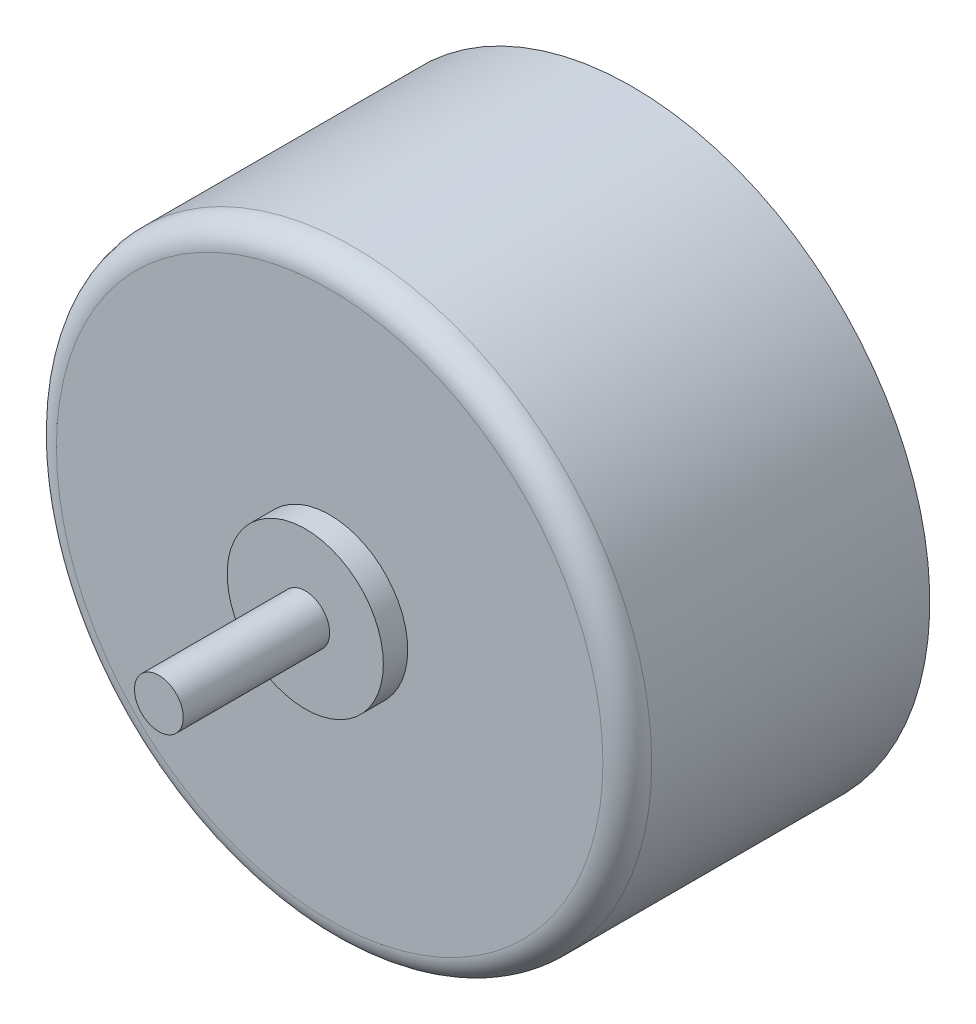
ISO-10303-21;
HEADER;
FILE_DESCRIPTION(('STEP AP214'),'2;1');
FILE_NAME('part.step','',(''),(''),'','','');
FILE_SCHEMA(('AUTOMOTIVE_DESIGN { 1 0 10303 214 1 1 1 1 }'));
ENDSEC;
DATA;
#1=APPLICATION_CONTEXT('core data for automotive mechanical design processes');
#2=APPLICATION_PROTOCOL_DEFINITION('international standard','automotive_design',2000,#1);
#3=PRODUCT_CONTEXT('',#1,'mechanical');
#4=PRODUCT('Part','Part','',(#3));
#5=PRODUCT_RELATED_PRODUCT_CATEGORY('part','',(#4));
#6=PRODUCT_DEFINITION_FORMATION('','',#4);
#7=PRODUCT_DEFINITION_CONTEXT('part definition',#1,'design');
#8=PRODUCT_DEFINITION('design','',#6,#7);
#9=PRODUCT_DEFINITION_SHAPE('','',#8);
#10=(LENGTH_UNIT() NAMED_UNIT(*) SI_UNIT(.MILLI.,.METRE.));
#11=(NAMED_UNIT(*) PLANE_ANGLE_UNIT() SI_UNIT($,.RADIAN.));
#12=(NAMED_UNIT(*) SI_UNIT($,.STERADIAN.) SOLID_ANGLE_UNIT());
#13=UNCERTAINTY_MEASURE_WITH_UNIT(LENGTH_MEASURE(1.E-05),#10,'distance_accuracy_value','');
#14=(GEOMETRIC_REPRESENTATION_CONTEXT(3) GLOBAL_UNCERTAINTY_ASSIGNED_CONTEXT((#13)) GLOBAL_UNIT_ASSIGNED_CONTEXT((#10,
#11,#12)) REPRESENTATION_CONTEXT('',''));
#15=CARTESIAN_POINT('',(0.,0.,0.));
#16=DIRECTION('',(0.,0.,1.));
#17=DIRECTION('',(1.,0.,0.));
#18=AXIS2_PLACEMENT_3D('',#15,#16,#17);
#19=CARTESIAN_POINT('',(0.,0.,12.4));
#20=DIRECTION('',(0.,0.,-1.));
#21=DIRECTION('',(-1.,0.,0.));
#22=AXIS2_PLACEMENT_3D('',#19,#20,#21);
#23=CYLINDRICAL_SURFACE('',#22,12.2);
#24=CARTESIAN_POINT('',(0.,0.,11.4));
#25=DIRECTION('',(0.,0.,1.));
#26=DIRECTION('',(1.,0.,0.));
#27=AXIS2_PLACEMENT_3D('',#24,#25,#26);
#28=CIRCLE('',#27,12.2);
#29=CARTESIAN_POINT('',(12.2,0.,11.4));
#30=VERTEX_POINT('',#29);
#31=EDGE_CURVE('E11',#30,#30,#28,.F.);
#32=ORIENTED_EDGE('',*,*,#31,.T.);
#33=EDGE_LOOP('',(#32));
#34=FACE_BOUND('',#33,.T.);
#35=CARTESIAN_POINT('',(0.,0.,0.));
#36=DIRECTION('',(0.,0.,1.));
#37=DIRECTION('',(1.,0.,0.));
#38=AXIS2_PLACEMENT_3D('',#35,#36,#37);
#39=CIRCLE('',#38,12.2);
#40=CARTESIAN_POINT('',(-12.0349491066643,-2.,0.));
#41=VERTEX_POINT('',#40);
#42=CARTESIAN_POINT('',(-12.0349491066643,2.,0.));
#43=VERTEX_POINT('',#42);
#44=EDGE_CURVE('E126',#41,#43,#39,.T.);
#45=ORIENTED_EDGE('',*,*,#44,.T.);
#46=DIRECTION('',(0.,0.,-1.));
#47=VECTOR('',#46,1.);
#48=CARTESIAN_POINT('',(-12.0349491066643,2.,12.4));
#49=LINE('',#48,#47);
#50=CARTESIAN_POINT('',(-12.0349491066643,2.,4.));
#51=VERTEX_POINT('',#50);
#52=EDGE_CURVE('E113',#43,#51,#49,.F.);
#53=ORIENTED_EDGE('',*,*,#52,.T.);
#54=CARTESIAN_POINT('',(0.,0.,4.));
#55=DIRECTION('',(0.,0.,1.));
#56=DIRECTION('',(1.,0.,0.));
#57=AXIS2_PLACEMENT_3D('',#54,#55,#56);
#58=CIRCLE('',#57,12.2);
#59=CARTESIAN_POINT('',(-12.0349491066643,-2.,4.));
#60=VERTEX_POINT('',#59);
#61=EDGE_CURVE('E62',#51,#60,#58,.T.);
#62=ORIENTED_EDGE('',*,*,#61,.T.);
#63=DIRECTION('',(0.,0.,-1.));
#64=VECTOR('',#63,1.);
#65=CARTESIAN_POINT('',(-12.0349491066643,-2.,12.4));
#66=LINE('',#65,#64);
#67=EDGE_CURVE('E82',#60,#41,#66,.T.);
#68=ORIENTED_EDGE('',*,*,#67,.T.);
#69=EDGE_LOOP('',(#45,#53,#62,#68));
#70=FACE_BOUND('',#69,.T.);
#71=ADVANCED_FACE('F39',(#34,#70),#23,.T.);
#72=CARTESIAN_POINT('',(0.,0.,12.4));
#73=DIRECTION('',(0.,0.,1.));
#74=DIRECTION('',(1.,0.,0.));
#75=AXIS2_PLACEMENT_3D('',#72,#73,#74);
#76=PLANE('',#75);
#77=CARTESIAN_POINT('',(0.,0.,12.4));
#78=DIRECTION('',(0.,0.,1.));
#79=DIRECTION('',(1.,0.,0.));
#80=AXIS2_PLACEMENT_3D('',#77,#78,#79);
#81=CIRCLE('',#80,11.2);
#82=CARTESIAN_POINT('',(11.2,0.,12.4));
#83=VERTEX_POINT('',#82);
#84=EDGE_CURVE('E47',#83,#83,#81,.T.);
#85=ORIENTED_EDGE('',*,*,#84,.T.);
#86=EDGE_LOOP('',(#85));
#87=FACE_BOUND('',#86,.T.);
#88=CARTESIAN_POINT('',(0.,0.,12.4));
#89=DIRECTION('',(0.,0.,1.));
#90=DIRECTION('',(1.,0.,0.));
#91=AXIS2_PLACEMENT_3D('',#88,#89,#90);
#92=CIRCLE('',#91,3.2);
#93=CARTESIAN_POINT('',(3.2,0.,12.4));
#94=VERTEX_POINT('',#93);
#95=EDGE_CURVE('E116',#94,#94,#92,.T.);
#96=ORIENTED_EDGE('',*,*,#95,.F.);
#97=EDGE_LOOP('',(#96));
#98=FACE_BOUND('',#97,.T.);
#99=ADVANCED_FACE('F184',(#87,#98),#76,.T.);
#100=CARTESIAN_POINT('',(0.,0.,0.));
#101=DIRECTION('',(0.,0.,1.));
#102=DIRECTION('',(1.,0.,0.));
#103=AXIS2_PLACEMENT_3D('',#100,#101,#102);
#104=PLANE('',#103);
#105=ORIENTED_EDGE('',*,*,#44,.F.);
#106=DIRECTION('',(1.,0.,0.));
#107=VECTOR('',#106,1.);
#108=CARTESIAN_POINT('',(-12.5,-2.,0.));
#109=LINE('',#108,#107);
#110=CARTESIAN_POINT('',(-12.5,-2.,0.));
#111=VERTEX_POINT('',#110);
#112=EDGE_CURVE('E54',#111,#41,#109,.T.);
#113=ORIENTED_EDGE('',*,*,#112,.F.);
#114=DIRECTION('',(0.,1.,0.));
#115=VECTOR('',#114,1.);
#116=CARTESIAN_POINT('',(-12.5,2.,0.));
#117=LINE('',#116,#115);
#118=CARTESIAN_POINT('',(-12.5,2.,0.));
#119=VERTEX_POINT('',#118);
#120=EDGE_CURVE('E94',#111,#119,#117,.T.);
#121=ORIENTED_EDGE('',*,*,#120,.T.);
#122=DIRECTION('',(1.,0.,0.));
#123=VECTOR('',#122,1.);
#124=CARTESIAN_POINT('',(-12.5,2.,0.));
#125=LINE('',#124,#123);
#126=EDGE_CURVE('E108',#119,#43,#125,.T.);
#127=ORIENTED_EDGE('',*,*,#126,.T.);
#128=EDGE_LOOP('',(#105,#113,#121,#127));
#129=FACE_BOUND('',#128,.T.);
#130=ADVANCED_FACE('F176',(#129),#104,.F.);
#131=CARTESIAN_POINT('',(0.,0.,13.4));
#132=DIRECTION('',(0.,0.,-1.));
#133=DIRECTION('',(-1.,0.,0.));
#134=AXIS2_PLACEMENT_3D('',#131,#132,#133);
#135=CYLINDRICAL_SURFACE('',#134,3.2);
#136=CARTESIAN_POINT('',(0.,0.,13.4));
#137=DIRECTION('',(0.,0.,1.));
#138=DIRECTION('',(1.,0.,0.));
#139=AXIS2_PLACEMENT_3D('',#136,#137,#138);
#140=CIRCLE('',#139,3.2);
#141=CARTESIAN_POINT('',(3.2,0.,13.4));
#142=VERTEX_POINT('',#141);
#143=EDGE_CURVE('E117',#142,#142,#140,.T.);
#144=ORIENTED_EDGE('',*,*,#143,.F.);
#145=EDGE_LOOP('',(#144));
#146=FACE_BOUND('',#145,.T.);
#147=ORIENTED_EDGE('',*,*,#95,.T.);
#148=EDGE_LOOP('',(#147));
#149=FACE_BOUND('',#148,.T.);
#150=ADVANCED_FACE('F172',(#146,#149),#135,.T.);
#151=CARTESIAN_POINT('',(0.,0.,13.4));
#152=DIRECTION('',(0.,0.,1.));
#153=DIRECTION('',(1.,0.,0.));
#154=AXIS2_PLACEMENT_3D('',#151,#152,#153);
#155=PLANE('',#154);
#156=CARTESIAN_POINT('',(0.,0.,13.4));
#157=DIRECTION('',(0.,0.,1.));
#158=DIRECTION('',(1.,0.,0.));
#159=AXIS2_PLACEMENT_3D('',#156,#157,#158);
#160=CIRCLE('',#159,1.);
#161=CARTESIAN_POINT('',(1.,0.,13.4));
#162=VERTEX_POINT('',#161);
#163=EDGE_CURVE('E120',#162,#162,#160,.T.);
#164=ORIENTED_EDGE('',*,*,#163,.F.);
#165=EDGE_LOOP('',(#164));
#166=FACE_BOUND('',#165,.T.);
#167=ORIENTED_EDGE('',*,*,#143,.T.);
#168=EDGE_LOOP('',(#167));
#169=FACE_BOUND('',#168,.T.);
#170=ADVANCED_FACE('F168',(#166,#169),#155,.T.);
#171=CARTESIAN_POINT('',(0.,0.,19.4));
#172=DIRECTION('',(0.,0.,1.));
#173=DIRECTION('',(1.,0.,0.));
#174=AXIS2_PLACEMENT_3D('',#171,#172,#173);
#175=PLANE('',#174);
#176=CARTESIAN_POINT('',(0.,0.,19.4));
#177=DIRECTION('',(0.,0.,1.));
#178=DIRECTION('',(1.,0.,0.));
#179=AXIS2_PLACEMENT_3D('',#176,#177,#178);
#180=CIRCLE('',#179,1.);
#181=CARTESIAN_POINT('',(1.,0.,19.4));
#182=VERTEX_POINT('',#181);
#183=EDGE_CURVE('E123',#182,#182,#180,.T.);
#184=ORIENTED_EDGE('',*,*,#183,.T.);
#185=EDGE_LOOP('',(#184));
#186=FACE_BOUND('',#185,.T.);
#187=ADVANCED_FACE('F171',(#186),#175,.T.);
#188=CARTESIAN_POINT('',(0.,0.,19.4));
#189=DIRECTION('',(0.,0.,-1.));
#190=DIRECTION('',(-1.,0.,0.));
#191=AXIS2_PLACEMENT_3D('',#188,#189,#190);
#192=CYLINDRICAL_SURFACE('',#191,1.);
#193=ORIENTED_EDGE('',*,*,#163,.T.);
#194=EDGE_LOOP('',(#193));
#195=FACE_BOUND('',#194,.T.);
#196=ORIENTED_EDGE('',*,*,#183,.F.);
#197=EDGE_LOOP('',(#196));
#198=FACE_BOUND('',#197,.T.);
#199=ADVANCED_FACE('F155',(#195,#198),#192,.T.);
#200=CARTESIAN_POINT('',(-12.5,1.,3.));
#201=DIRECTION('',(1.,0.,0.));
#202=DIRECTION('',(0.,0.,-1.));
#203=AXIS2_PLACEMENT_3D('',#200,#201,#202);
#204=CYLINDRICAL_SURFACE('',#203,0.75);
#205=CARTESIAN_POINT('',(-12.5,1.,3.));
#206=DIRECTION('',(1.,0.,0.));
#207=DIRECTION('',(0.,0.,-1.));
#208=AXIS2_PLACEMENT_3D('',#205,#206,#207);
#209=CIRCLE('',#208,0.75);
#210=CARTESIAN_POINT('',(-12.5,1.,2.25));
#211=VERTEX_POINT('',#210);
#212=EDGE_CURVE('E98',#211,#211,#209,.T.);
#213=ORIENTED_EDGE('',*,*,#212,.F.);
#214=EDGE_LOOP('',(#213));
#215=FACE_BOUND('',#214,.T.);
#216=CARTESIAN_POINT('',(-12.1589473228565,1.,2.25));
#217=CARTESIAN_POINT('',(-12.1554660815358,1.04232436183492,2.25000186793378));
#218=CARTESIAN_POINT('',(-12.1517596029734,1.08466080886121,2.25359464915019));
#219=CARTESIAN_POINT('',(-12.1440206278392,1.16812923663822,2.26785971389928));
#220=CARTESIAN_POINT('',(-12.1399877373327,1.2092596778725,2.27854066720956));
#221=CARTESIAN_POINT('',(-12.1317696202634,1.2890987380346,2.30666645365124));
#222=CARTESIAN_POINT('',(-12.1275844861602,1.32780878930077,2.3241072415988));
#223=CARTESIAN_POINT('',(-12.119262759367,1.4017330497506,2.36525600284007));
#224=CARTESIAN_POINT('',(-12.115126155272,1.43694809541888,2.38896247152408));
#225=CARTESIAN_POINT('',(-12.1071149500195,1.50295595851322,2.44202924206153));
#226=CARTESIAN_POINT('',(-12.1032407879033,1.53374145790481,2.47139871663681));
#227=CARTESIAN_POINT('',(-12.0959869589559,1.58993849654611,2.53494975492749));
#228=CARTESIAN_POINT('',(-12.0926073019615,1.61534992889716,2.5691314143423));
#229=CARTESIAN_POINT('',(-12.086565088973,1.65995501595592,2.64118679398431));
#230=CARTESIAN_POINT('',(-12.0838994748495,1.67917526061758,2.67904379133044));
#231=CARTESIAN_POINT('',(-12.0794381511156,1.71097440804182,2.7574991129133));
#232=CARTESIAN_POINT('',(-12.0776423897387,1.72355370602196,2.79809727385504));
#233=CARTESIAN_POINT('',(-12.0750524321705,1.74160615053343,2.88048906767797));
#234=CARTESIAN_POINT('',(-12.0742493258924,1.74714252776695,2.92226857039009));
#235=CARTESIAN_POINT('',(-12.0736688569655,1.7511495466174,3.00617124618749));
#236=CARTESIAN_POINT('',(-12.0738914495659,1.74962049649549,3.04829440419922));
#237=CARTESIAN_POINT('',(-12.0753429784191,1.73957375882602,3.13142907402674));
#238=CARTESIAN_POINT('',(-12.0765660163599,1.73109703202464,3.17244564961066));
#239=CARTESIAN_POINT('',(-12.0799303290053,1.70746143324579,3.25246556699938));
#240=CARTESIAN_POINT('',(-12.0820716150274,1.69230247890992,3.29146888398418));
#241=CARTESIAN_POINT('',(-12.0871427626813,1.65569339283597,3.36648791187978));
#242=CARTESIAN_POINT('',(-12.0900749324705,1.63422483009884,3.40249446787865));
#243=CARTESIAN_POINT('',(-12.0965437198809,1.58563202495781,3.4704025782802));
#244=CARTESIAN_POINT('',(-12.10008036682,1.55850750821919,3.50230393344403));
#245=CARTESIAN_POINT('',(-12.1075840902881,1.4991029254735,3.56139729596432));
#246=CARTESIAN_POINT('',(-12.1115546996507,1.46677935056866,3.58854511938825));
#247=CARTESIAN_POINT('',(-12.1196793185417,1.398058857102,3.63703836392375));
#248=CARTESIAN_POINT('',(-12.1238333357382,1.36166176813395,3.65838354216664));
#249=CARTESIAN_POINT('',(-12.1321407238707,1.28554854869154,3.69480487206638));
#250=CARTESIAN_POINT('',(-12.1362939012501,1.24581167666808,3.70983774369182));
#251=CARTESIAN_POINT('',(-12.1443797556944,1.16435154708569,3.73299493194349));
#252=CARTESIAN_POINT('',(-12.1483124321064,1.12262828364559,3.74111922811391));
#253=CARTESIAN_POINT('',(-12.1558036597805,1.03837634201233,3.75021490967084));
#254=CARTESIAN_POINT('',(-12.1593622209692,0.995847685224675,3.75118648489347));
#255=CARTESIAN_POINT('',(-12.1659984393476,0.91119944201663,3.74593066598448));
#256=CARTESIAN_POINT('',(-12.1690761081609,0.86907984573188,3.73970344588629));
#257=CARTESIAN_POINT('',(-12.1746820851988,0.786648709141385,3.72025450130146));
#258=CARTESIAN_POINT('',(-12.1772127795931,0.746329950304057,3.70706405891058));
#259=CARTESIAN_POINT('',(-12.1817354877638,0.668463076476346,3.67407054658591));
#260=CARTESIAN_POINT('',(-12.1837275130296,0.630914902403304,3.65426761771303));
#261=CARTESIAN_POINT('',(-12.1872013089156,0.559811077106433,3.6086954005438));
#262=CARTESIAN_POINT('',(-12.1886850047152,0.526240684374822,3.58294925543636));
#263=CARTESIAN_POINT('',(-12.1912174312804,0.463889212456864,3.5261775969693));
#264=CARTESIAN_POINT('',(-12.1922661647373,0.435108103639105,3.49515211627545));
#265=CARTESIAN_POINT('',(-12.1940084524272,0.383189087057749,3.42874099045368));
#266=CARTESIAN_POINT('',(-12.1947024064095,0.360044843406134,3.39336030860933));
#267=CARTESIAN_POINT('',(-12.19581861568,0.320017119275756,3.3192150050529));
#268=CARTESIAN_POINT('',(-12.1962408709275,0.303133639737962,3.28045038283223));
#269=CARTESIAN_POINT('',(-12.1968828396371,0.27610348091764,3.20062429001835));
#270=CARTESIAN_POINT('',(-12.1971024889705,0.265958934922014,3.15956209655836));
#271=CARTESIAN_POINT('',(-12.1973843736969,0.252703488864342,3.07631707865122));
#272=CARTESIAN_POINT('',(-12.1974466085193,0.249592614298075,3.03413425014253));
#273=CARTESIAN_POINT('',(-12.197428146098,0.250493084868075,2.9498317136042));
#274=CARTESIAN_POINT('',(-12.1973474050059,0.254506614939325,2.90771202890476));
#275=CARTESIAN_POINT('',(-12.19702425631,0.269546103662163,2.82474428768572));
#276=CARTESIAN_POINT('',(-12.196781848265,0.280572081444603,2.7838962346356));
#277=CARTESIAN_POINT('',(-12.1960864459044,0.309323149291956,2.70463085337263));
#278=CARTESIAN_POINT('',(-12.1956334471314,0.327048381154276,2.66621357663003));
#279=CARTESIAN_POINT('',(-12.1944453760737,0.368692232164853,2.59290353636203));
#280=CARTESIAN_POINT('',(-12.1937103152705,0.392610599205248,2.55801062944823));
#281=CARTESIAN_POINT('',(-12.1918760345862,0.445946718725099,2.49275236300583));
#282=CARTESIAN_POINT('',(-12.1907769642598,0.475362210530541,2.46238515149515));
#283=CARTESIAN_POINT('',(-12.1881348222321,0.538866612523008,2.40701536740619));
#284=CARTESIAN_POINT('',(-12.1865916466445,0.572956615206999,2.38201405242542));
#285=CARTESIAN_POINT('',(-12.183000114832,0.644827182834973,2.33808836822093));
#286=CARTESIAN_POINT('',(-12.1809516917276,0.682608235962946,2.31916480427285));
#287=CARTESIAN_POINT('',(-12.1763207337536,0.760748963692226,2.28794295312024));
#288=CARTESIAN_POINT('',(-12.173738824289,0.801105581018944,2.27563696845492));
#289=CARTESIAN_POINT('',(-12.1691041250114,0.868092485168475,2.26121325116531));
#290=CARTESIAN_POINT('',(-12.1672067176025,0.894303610248425,2.25701240114455));
#291=CARTESIAN_POINT('',(-12.1632180763101,0.947008244867373,2.25140519326285));
#292=CARTESIAN_POINT('',(-12.1611268427643,0.973501753914227,2.24999883053242));
#293=CARTESIAN_POINT('',(-12.1589473228565,1.,2.25));
#294=B_SPLINE_CURVE_WITH_KNOTS('',3,(#216,#217,#218,#219,#220,#221,#222,#223,#224,#225,#226,
#227,#228,#229,#230,#231,#232,#233,#234,#235,#236,#237,#238,#239,#240,#241,#242,#243,#244,#245,
#246,#247,#248,#249,#250,#251,#252,#253,#254,#255,#256,#257,#258,#259,#260,#261,#262,#263,#264,
#265,#266,#267,#268,#269,#270,#271,#272,#273,#274,#275,#276,#277,#278,#279,#280,#281,#282,#283,
#284,#285,#286,#287,#288,#289,#290,#291,#292,#293),.UNSPECIFIED.,.T.,.F.,(4,2,2,2,2,2,2,2,2,2,2,
2,2,2,2,2,2,2,2,2,2,2,2,2,2,2,2,2,2,2,2,2,2,2,2,2,2,2,4),(0.,0.127304480009304,
0.254764958035521,0.382149279319942,0.509503038909592,0.637064840957067,0.764629180171032,
0.891638115258049,1.01863949090751,1.14449242159816,1.27033986143858,1.39545064670773,
1.52056297400944,1.64604446229289,1.77153203830933,1.8981303604543,2.02473398053376,
2.15219201213563,2.27965042113043,2.40710544731529,2.5345573922942,2.66144157525128,
2.7883230516235,2.91471853989699,3.04111324612957,3.16736522102558,3.29361721489676,
3.41990915626682,3.54620155542144,3.67253269302103,3.79886417526955,3.92519833161874,
4.051527346012,4.17780452189726,4.30411126094347,4.43043472818712,4.55661093843552,
4.63631329355787,4.716015509796),.UNSPECIFIED.);
#295=CARTESIAN_POINT('',(-12.1589473228565,1.,2.25));
#296=VERTEX_POINT('',#295);
#297=EDGE_CURVE('E138',#296,#296,#294,.T.);
#298=ORIENTED_EDGE('',*,*,#297,.T.);
#299=EDGE_LOOP('',(#298));
#300=FACE_BOUND('',#299,.T.);
#301=ADVANCED_FACE('F150',(#215,#300),#204,.F.);
#302=CARTESIAN_POINT('',(-12.5,-1.,3.));
#303=DIRECTION('',(1.,0.,0.));
#304=DIRECTION('',(0.,0.,-1.));
#305=AXIS2_PLACEMENT_3D('',#302,#303,#304);
#306=CYLINDRICAL_SURFACE('',#305,0.75);
#307=CARTESIAN_POINT('',(-12.5,-1.,3.));
#308=DIRECTION('',(1.,0.,0.));
#309=DIRECTION('',(0.,0.,-1.));
#310=AXIS2_PLACEMENT_3D('',#307,#308,#309);
#311=CIRCLE('',#310,0.75);
#312=CARTESIAN_POINT('',(-12.5,-1.,2.25));
#313=VERTEX_POINT('',#312);
#314=EDGE_CURVE('E101',#313,#313,#311,.T.);
#315=ORIENTED_EDGE('',*,*,#314,.F.);
#316=EDGE_LOOP('',(#315));
#317=FACE_BOUND('',#316,.T.);
#318=CARTESIAN_POINT('',(-12.1589473228565,-1.,2.25));
#319=CARTESIAN_POINT('',(-12.1624059407147,-0.957943155547269,2.25000181089656));
#320=CARTESIAN_POINT('',(-12.1656469999043,-0.915839566043507,2.25354913192505));
#321=CARTESIAN_POINT('',(-12.1716168892871,-0.832755984268154,2.26766900158376));
#322=CARTESIAN_POINT('',(-12.1743451488616,-0.791777286499906,2.27824931751927));
#323=CARTESIAN_POINT('',(-12.1792619013344,-0.712158764217287,2.30615167185516));
#324=CARTESIAN_POINT('',(-12.1814505635243,-0.673518209019879,2.32347159138619));
#325=CARTESIAN_POINT('',(-12.1853085516487,-0.599686496561647,2.36436660456944));
#326=CARTESIAN_POINT('',(-12.1869779975947,-0.564494543482184,2.38794025039999));
#327=CARTESIAN_POINT('',(-12.1898505673364,-0.49862779760742,2.44062462139117));
#328=CARTESIAN_POINT('',(-12.1910546190991,-0.467944092212982,2.46972415358911));
#329=CARTESIAN_POINT('',(-12.193077439504,-0.411887568371721,2.53266726015328));
#330=CARTESIAN_POINT('',(-12.1938961954942,-0.38651492434199,2.5665109902597));
#331=CARTESIAN_POINT('',(-12.1952311295095,-0.341817639102977,2.63796281204535));
#332=CARTESIAN_POINT('',(-12.1957474559839,-0.322490032825654,2.67556904624538));
#333=CARTESIAN_POINT('',(-12.1965535037325,-0.290416071449728,2.75349266948608));
#334=CARTESIAN_POINT('',(-12.1968432250159,-0.277669716081257,2.79381005841558));
#335=CARTESIAN_POINT('',(-12.1972515599838,-0.259116667165043,2.87602950778208));
#336=CARTESIAN_POINT('',(-12.197370102943,-0.253312842209906,2.91793221588699));
#337=CARTESIAN_POINT('',(-12.197462613383,-0.248819356740447,3.00211748343382));
#338=CARTESIAN_POINT('',(-12.19743658086,-0.250129696408758,3.04440004288549));
#339=CARTESIAN_POINT('',(-12.1972337959496,-0.259828347554342,3.12815420750184));
#340=CARTESIAN_POINT('',(-12.1970570116953,-0.268218155539209,3.16962563930805));
#341=CARTESIAN_POINT('',(-12.1965145959367,-0.291839185981718,3.25057091028775));
#342=CARTESIAN_POINT('',(-12.1961489642358,-0.307070415564999,3.29004474738062));
#343=CARTESIAN_POINT('',(-12.1951647911756,-0.343939020143397,3.36587022993542));
#344=CARTESIAN_POINT('',(-12.1945462721366,-0.365575829719614,3.40222215060288));
#345=CARTESIAN_POINT('',(-12.1929764614867,-0.414638832316786,3.4707748306572));
#346=CARTESIAN_POINT('',(-12.1920251714693,-0.44206499761326,3.50297560992214));
#347=CARTESIAN_POINT('',(-12.1897079486127,-0.501910671002228,3.56230022844165));
#348=CARTESIAN_POINT('',(-12.1883421786802,-0.534328214826712,3.58942605559138));
#349=CARTESIAN_POINT('',(-12.1851259272702,-0.60323606432496,3.63784923031842));
#350=CARTESIAN_POINT('',(-12.1832754485823,-0.63972634655834,3.65914661143853));
#351=CARTESIAN_POINT('',(-12.1790465854818,-0.715731180945793,3.69531453645796));
#352=CARTESIAN_POINT('',(-12.1766682487878,-0.755245459518336,3.71018566093477));
#353=CARTESIAN_POINT('',(-12.1713786519939,-0.836172812820082,3.73309566016053));
#354=CARTESIAN_POINT('',(-12.168467388252,-0.877585900524593,3.74113448821438));
#355=CARTESIAN_POINT('',(-12.1621472701161,-0.961215434736875,3.75017869048467));
#356=CARTESIAN_POINT('',(-12.1587374789046,-1.00343326065376,3.75117064446059));
#357=CARTESIAN_POINT('',(-12.1515154306327,-1.08740472311453,3.74607631603524));
#358=CARTESIAN_POINT('',(-12.1477031624384,-1.1291583467816,3.73998983777266));
#359=CARTESIAN_POINT('',(-12.1397966294975,-1.2112163875528,3.72088150317337));
#360=CARTESIAN_POINT('',(-12.1357011898032,-1.25151356146129,3.70782902818489));
#361=CARTESIAN_POINT('',(-12.1274234463442,-1.3293356962834,3.67514390711982));
#362=CARTESIAN_POINT('',(-12.1232411399338,-1.36686057260172,3.65551106034756));
#363=CARTESIAN_POINT('',(-12.1149830996417,-1.43822155511228,3.61012822151926));
#364=CARTESIAN_POINT('',(-12.1109078200864,-1.47204341978671,3.58435574535687));
#365=CARTESIAN_POINT('',(-12.1031053006825,-1.53487669691962,3.5274499384622));
#366=CARTESIAN_POINT('',(-12.0993780599049,-1.56388812221611,3.49631662203727));
#367=CARTESIAN_POINT('',(-12.092500141416,-1.61621078925713,3.42962428667739));
#368=CARTESIAN_POINT('',(-12.0893483349796,-1.63953322095055,3.39407416679692));
#369=CARTESIAN_POINT('',(-12.0838103623833,-1.67986410299529,3.31950182886826));
#370=CARTESIAN_POINT('',(-12.0814241573576,-1.69687287386632,3.28047978720059));
#371=CARTESIAN_POINT('',(-12.0775898503677,-1.72395190469347,3.20041216421908));
#372=CARTESIAN_POINT('',(-12.0761342141866,-1.73407793321584,3.15938580635048));
#373=CARTESIAN_POINT('',(-12.0742272069977,-1.7473073125921,3.07619380551232));
#374=CARTESIAN_POINT('',(-12.0737757841804,-1.75041102574146,3.03402822143133));
#375=CARTESIAN_POINT('',(-12.0739070665454,-1.74950510817542,2.95010679510188));
#376=CARTESIAN_POINT('',(-12.0744817042323,-1.74555097055123,2.9083503292003));
#377=CARTESIAN_POINT('',(-12.0766111162188,-1.73075678061286,2.82610226664547));
#378=CARTESIAN_POINT('',(-12.078165885759,-1.71991676173434,2.78561066385144));
#379=CARTESIAN_POINT('',(-12.0821537322351,-1.69167464938989,2.70703375272068));
#380=CARTESIAN_POINT('',(-12.0845867830267,-1.67427275125486,2.66894837279606));
#381=CARTESIAN_POINT('',(-12.0901769175512,-1.63341526668018,2.59623733246649));
#382=CARTESIAN_POINT('',(-12.0933340037944,-1.60995965925302,2.56161168405661));
#383=CARTESIAN_POINT('',(-12.1002072525242,-1.55746224028596,2.49651453985805));
#384=CARTESIAN_POINT('',(-12.1039274926458,-1.52837921573969,2.46607671645304));
#385=CARTESIAN_POINT('',(-12.1116946065851,-1.46555571109129,2.41049399725234));
#386=CARTESIAN_POINT('',(-12.1157415735331,-1.43181390108708,2.38535061800819));
#387=CARTESIAN_POINT('',(-12.1239789430198,-1.36030883272427,2.34085908545004));
#388=CARTESIAN_POINT('',(-12.128170289301,-1.32251303957849,2.32156343908125));
#389=CARTESIAN_POINT('',(-12.1364504018617,-1.24423251234551,2.28962430370213));
#390=CARTESIAN_POINT('',(-12.1405392792718,-1.20375088192701,2.27697328213117));
#391=CARTESIAN_POINT('',(-12.1470383021168,-1.13586141778525,2.26190211882361));
#392=CARTESIAN_POINT('',(-12.1495304899626,-1.10889623787187,2.25744580266041));
#393=CARTESIAN_POINT('',(-12.1543615024062,-1.05462728252391,2.2514941521779));
#394=CARTESIAN_POINT('',(-12.1567003267119,-1.02732350644478,2.24999882349604));
#395=CARTESIAN_POINT('',(-12.1589473228565,-1.,2.25));
#396=B_SPLINE_CURVE_WITH_KNOTS('',3,(#318,#319,#320,#321,#322,#323,#324,#325,#326,#327,#328,
#329,#330,#331,#332,#333,#334,#335,#336,#337,#338,#339,#340,#341,#342,#343,#344,#345,#346,#347,
#348,#349,#350,#351,#352,#353,#354,#355,#356,#357,#358,#359,#360,#361,#362,#363,#364,#365,#366,
#367,#368,#369,#370,#371,#372,#373,#374,#375,#376,#377,#378,#379,#380,#381,#382,#383,#384,#385,
#386,#387,#388,#389,#390,#391,#392,#393,#394,#395),.UNSPECIFIED.,.T.,.F.,(4,2,2,2,2,2,2,2,2,2,2,
2,2,2,2,2,2,2,2,2,2,2,2,2,2,2,2,2,2,2,2,2,2,2,2,2,2,2,4),(0.,0.126497058379436,
0.253134053920845,0.379731268081469,0.506299198825048,0.632613442854972,0.758931834437792,
0.885188169809061,1.01144450000312,1.13775298020417,1.26406146364775,1.39039665375378,
1.51673197544372,1.64305614887052,1.7693797173608,1.89565369992615,2.02192695576717,
2.14818880111683,2.27445150939193,2.40095461117366,2.52746121339913,2.65452850410991,
2.78159967061636,2.9091435421407,3.03668707327303,3.16397767265287,3.29126180910625,
3.4175019012974,3.5437354803582,3.66898090254256,3.79422571657924,3.91946680268187,
4.0447083229868,4.17090437689831,4.29713652964342,4.42447065613806,4.55166011929533,
4.63384261906022,4.71602527529256),.UNSPECIFIED.);
#397=CARTESIAN_POINT('',(-12.1589473228565,-1.,2.25));
#398=VERTEX_POINT('',#397);
#399=EDGE_CURVE('E129',#398,#398,#396,.T.);
#400=ORIENTED_EDGE('',*,*,#399,.T.);
#401=EDGE_LOOP('',(#400));
#402=FACE_BOUND('',#401,.T.);
#403=ADVANCED_FACE('F146',(#317,#402),#306,.F.);
#404=CARTESIAN_POINT('',(-12.5,2.,4.));
#405=DIRECTION('',(0.,1.,0.));
#406=DIRECTION('',(0.,0.,1.));
#407=AXIS2_PLACEMENT_3D('',#404,#405,#406);
#408=PLANE('',#407);
#409=ORIENTED_EDGE('',*,*,#52,.F.);
#410=ORIENTED_EDGE('',*,*,#126,.F.);
#411=DIRECTION('',(0.,0.,1.));
#412=VECTOR('',#411,1.);
#413=CARTESIAN_POINT('',(-12.5,2.,4.));
#414=LINE('',#413,#412);
#415=CARTESIAN_POINT('',(-12.5,2.,4.));
#416=VERTEX_POINT('',#415);
#417=EDGE_CURVE('E84',#119,#416,#414,.T.);
#418=ORIENTED_EDGE('',*,*,#417,.T.);
#419=DIRECTION('',(1.,0.,0.));
#420=VECTOR('',#419,1.);
#421=CARTESIAN_POINT('',(-12.5,2.,4.));
#422=LINE('',#421,#420);
#423=EDGE_CURVE('E97',#416,#51,#422,.T.);
#424=ORIENTED_EDGE('',*,*,#423,.T.);
#425=EDGE_LOOP('',(#409,#410,#418,#424));
#426=FACE_BOUND('',#425,.T.);
#427=ADVANCED_FACE('F149',(#426),#408,.T.);
#428=CARTESIAN_POINT('',(-12.5,-2.,4.));
#429=DIRECTION('',(0.,-1.,0.));
#430=DIRECTION('',(0.,0.,-1.));
#431=AXIS2_PLACEMENT_3D('',#428,#429,#430);
#432=PLANE('',#431);
#433=ORIENTED_EDGE('',*,*,#67,.F.);
#434=DIRECTION('',(1.,0.,0.));
#435=VECTOR('',#434,1.);
#436=CARTESIAN_POINT('',(-12.5,-2.,4.));
#437=LINE('',#436,#435);
#438=CARTESIAN_POINT('',(-12.5,-2.,4.));
#439=VERTEX_POINT('',#438);
#440=EDGE_CURVE('E78',#439,#60,#437,.T.);
#441=ORIENTED_EDGE('',*,*,#440,.F.);
#442=DIRECTION('',(0.,0.,-1.));
#443=VECTOR('',#442,1.);
#444=CARTESIAN_POINT('',(-12.5,-2.,4.));
#445=LINE('',#444,#443);
#446=EDGE_CURVE('E81',#439,#111,#445,.T.);
#447=ORIENTED_EDGE('',*,*,#446,.T.);
#448=ORIENTED_EDGE('',*,*,#112,.T.);
#449=EDGE_LOOP('',(#433,#441,#447,#448));
#450=FACE_BOUND('',#449,.T.);
#451=ADVANCED_FACE('F80',(#450),#432,.T.);
#452=CARTESIAN_POINT('',(-12.5,2.,4.));
#453=DIRECTION('',(0.,0.,1.));
#454=DIRECTION('',(1.,0.,0.));
#455=AXIS2_PLACEMENT_3D('',#452,#453,#454);
#456=PLANE('',#455);
#457=ORIENTED_EDGE('',*,*,#61,.F.);
#458=ORIENTED_EDGE('',*,*,#423,.F.);
#459=DIRECTION('',(0.,-1.,0.));
#460=VECTOR('',#459,1.);
#461=CARTESIAN_POINT('',(-12.5,2.,4.));
#462=LINE('',#461,#460);
#463=EDGE_CURVE('E91',#416,#439,#462,.T.);
#464=ORIENTED_EDGE('',*,*,#463,.T.);
#465=ORIENTED_EDGE('',*,*,#440,.T.);
#466=EDGE_LOOP('',(#457,#458,#464,#465));
#467=FACE_BOUND('',#466,.T.);
#468=ADVANCED_FACE('F96',(#467),#456,.T.);
#469=CARTESIAN_POINT('',(-12.5,0.,0.));
#470=DIRECTION('',(1.,0.,0.));
#471=DIRECTION('',(0.,0.,-1.));
#472=AXIS2_PLACEMENT_3D('',#469,#470,#471);
#473=PLANE('',#472);
#474=ORIENTED_EDGE('',*,*,#314,.T.);
#475=EDGE_LOOP('',(#474));
#476=FACE_BOUND('',#475,.T.);
#477=ORIENTED_EDGE('',*,*,#212,.T.);
#478=EDGE_LOOP('',(#477));
#479=FACE_BOUND('',#478,.T.);
#480=ORIENTED_EDGE('',*,*,#463,.F.);
#481=ORIENTED_EDGE('',*,*,#417,.F.);
#482=ORIENTED_EDGE('',*,*,#120,.F.);
#483=ORIENTED_EDGE('',*,*,#446,.F.);
#484=EDGE_LOOP('',(#480,#481,#482,#483));
#485=FACE_BOUND('',#484,.T.);
#486=ADVANCED_FACE('F89',(#476,#479,#485),#473,.F.);
#487=ORIENTED_EDGE('',*,*,#399,.F.);
#488=EDGE_LOOP('',(#487));
#489=FACE_BOUND('',#488,.T.);
#490=ADVANCED_FACE('F159',(#489),#23,.T.);
#491=ORIENTED_EDGE('',*,*,#297,.F.);
#492=EDGE_LOOP('',(#491));
#493=FACE_BOUND('',#492,.T.);
#494=ADVANCED_FACE('F194',(#493),#23,.T.);
#495=CARTESIAN_POINT('',(0.,0.,11.4));
#496=DIRECTION('',(0.,0.,1.));
#497=DIRECTION('',(1.,0.,0.));
#498=AXIS2_PLACEMENT_3D('',#495,#496,#497);
#499=TOROIDAL_SURFACE('',#498,11.2,1.);
#500=ORIENTED_EDGE('',*,*,#31,.F.);
#501=EDGE_LOOP('',(#500));
#502=FACE_BOUND('',#501,.T.);
#503=ORIENTED_EDGE('',*,*,#84,.F.);
#504=EDGE_LOOP('',(#503));
#505=FACE_BOUND('',#504,.T.);
#506=ADVANCED_FACE('F41',(#502,#505),#499,.T.);
#507=CLOSED_SHELL('',(#71,#99,#130,#150,#170,#187,#199,#301,#403,#427,#451,#468,#486,#490,#494,#506));
#508=MANIFOLD_SOLID_BREP('B2',#507);
#509=ADVANCED_BREP_SHAPE_REPRESENTATION('',(#18,#508),#14);
#510=SHAPE_DEFINITION_REPRESENTATION(#9,#509);
ENDSEC;
END-ISO-10303-21;
